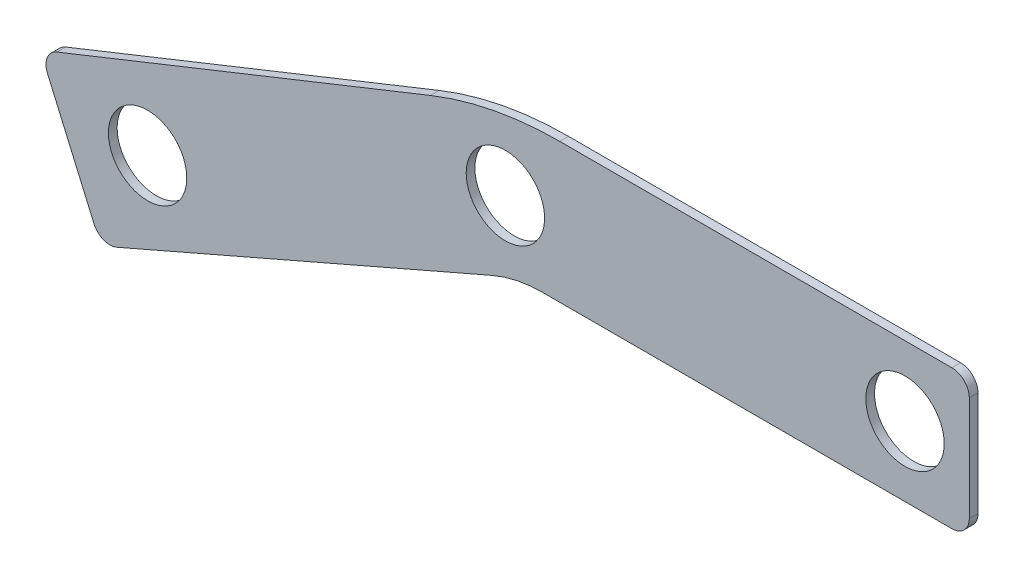
ISO-10303-21;
HEADER;
FILE_DESCRIPTION(('STEP AP214'),'2;1');
FILE_NAME('part.step','',(''),(''),'','','');
FILE_SCHEMA(('AUTOMOTIVE_DESIGN { 1 0 10303 214 1 1 1 1 }'));
ENDSEC;
DATA;
#1=APPLICATION_CONTEXT('core data for automotive mechanical design processes');
#2=APPLICATION_PROTOCOL_DEFINITION('international standard','automotive_design',2000,#1);
#3=PRODUCT_CONTEXT('',#1,'mechanical');
#4=PRODUCT('Part','Part','',(#3));
#5=PRODUCT_RELATED_PRODUCT_CATEGORY('part','',(#4));
#6=PRODUCT_DEFINITION_FORMATION('','',#4);
#7=PRODUCT_DEFINITION_CONTEXT('part definition',#1,'design');
#8=PRODUCT_DEFINITION('design','',#6,#7);
#9=PRODUCT_DEFINITION_SHAPE('','',#8);
#10=(LENGTH_UNIT() NAMED_UNIT(*) SI_UNIT(.MILLI.,.METRE.));
#11=(NAMED_UNIT(*) PLANE_ANGLE_UNIT() SI_UNIT($,.RADIAN.));
#12=(NAMED_UNIT(*) SI_UNIT($,.STERADIAN.) SOLID_ANGLE_UNIT());
#13=UNCERTAINTY_MEASURE_WITH_UNIT(LENGTH_MEASURE(1.E-05),#10,'distance_accuracy_value','');
#14=(GEOMETRIC_REPRESENTATION_CONTEXT(3) GLOBAL_UNCERTAINTY_ASSIGNED_CONTEXT((#13)) GLOBAL_UNIT_ASSIGNED_CONTEXT((#10,
#11,#12)) REPRESENTATION_CONTEXT('',''));
#15=CARTESIAN_POINT('',(0.,0.,0.));
#16=DIRECTION('',(0.,0.,1.));
#17=DIRECTION('',(1.,0.,0.));
#18=AXIS2_PLACEMENT_3D('',#15,#16,#17);
#19=CARTESIAN_POINT('',(0.,0.,3.175));
#20=DIRECTION('',(-0.398928701934795,0.916981946808452,0.));
#21=DIRECTION('',(-0.916981946808452,-0.398928701934795,0.));
#22=AXIS2_PLACEMENT_3D('',#19,#20,#21);
#23=PLANE('',#22);
#24=DIRECTION('',(0.916981946808452,0.398928701934795,0.));
#25=VECTOR('',#24,1.);
#26=CARTESIAN_POINT('',(0.,0.,3.175));
#27=LINE('',#26,#25);
#28=CARTESIAN_POINT('',(-145.570884055842,-63.3299314321487,3.175));
#29=VERTEX_POINT('',#28);
#30=CARTESIAN_POINT('',(-8.72457475503271,-3.79558539191755,3.175));
#31=VERTEX_POINT('',#30);
#32=EDGE_CURVE('E175',#29,#31,#27,.T.);
#33=ORIENTED_EDGE('',*,*,#32,.F.);
#34=DIRECTION('',(0.,0.,-1.));
#35=VECTOR('',#34,1.);
#36=CARTESIAN_POINT('',(-145.570884055842,-63.3299314321487,3.175));
#37=LINE('',#36,#35);
#38=CARTESIAN_POINT('',(-145.570884055842,-63.3299314321487,0.));
#39=VERTEX_POINT('',#38);
#40=EDGE_CURVE('E196',#29,#39,#37,.T.);
#41=ORIENTED_EDGE('',*,*,#40,.T.);
#42=DIRECTION('',(0.916981946808452,0.398928701934795,0.));
#43=VECTOR('',#42,1.);
#44=CARTESIAN_POINT('',(0.,0.,0.));
#45=LINE('',#44,#43);
#46=CARTESIAN_POINT('',(-8.72457475503271,-3.79558539191755,0.));
#47=VERTEX_POINT('',#46);
#48=EDGE_CURVE('E157',#39,#47,#45,.T.);
#49=ORIENTED_EDGE('',*,*,#48,.T.);
#50=DIRECTION('',(0.,0.,-1.));
#51=VECTOR('',#50,1.);
#52=CARTESIAN_POINT('',(-8.72457475503271,-3.79558539191755,3.175));
#53=LINE('',#52,#51);
#54=EDGE_CURVE('E136',#47,#31,#53,.F.);
#55=ORIENTED_EDGE('',*,*,#54,.T.);
#56=EDGE_LOOP('',(#33,#41,#49,#55));
#57=FACE_BOUND('',#56,.T.);
#58=ADVANCED_FACE('F39',(#57),#23,.F.);
#59=CARTESIAN_POINT('',(0.,0.,3.175));
#60=DIRECTION('',(0.,1.,0.));
#61=DIRECTION('',(0.,0.,1.));
#62=AXIS2_PLACEMENT_3D('',#59,#60,#61);
#63=PLANE('',#62);
#64=DIRECTION('',(1.,0.,0.));
#65=VECTOR('',#64,1.);
#66=CARTESIAN_POINT('',(0.,0.,0.));
#67=LINE('',#66,#65);
#68=CARTESIAN_POINT('',(9.51444549742612,0.,0.));
#69=VERTEX_POINT('',#68);
#70=CARTESIAN_POINT('',(158.75,0.,0.));
#71=VERTEX_POINT('',#70);
#72=EDGE_CURVE('E146',#69,#71,#67,.T.);
#73=ORIENTED_EDGE('',*,*,#72,.T.);
#74=DIRECTION('',(0.,0.,-1.));
#75=VECTOR('',#74,1.);
#76=CARTESIAN_POINT('',(158.75,0.,3.175));
#77=LINE('',#76,#75);
#78=CARTESIAN_POINT('',(158.75,0.,3.175));
#79=VERTEX_POINT('',#78);
#80=EDGE_CURVE('E230',#71,#79,#77,.F.);
#81=ORIENTED_EDGE('',*,*,#80,.T.);
#82=DIRECTION('',(1.,0.,0.));
#83=VECTOR('',#82,1.);
#84=CARTESIAN_POINT('',(0.,0.,3.175));
#85=LINE('',#84,#83);
#86=CARTESIAN_POINT('',(9.51444549742612,0.,3.175));
#87=VERTEX_POINT('',#86);
#88=EDGE_CURVE('E149',#87,#79,#85,.T.);
#89=ORIENTED_EDGE('',*,*,#88,.F.);
#90=DIRECTION('',(0.,0.,-1.));
#91=VECTOR('',#90,1.);
#92=CARTESIAN_POINT('',(9.51444549742612,0.,0.));
#93=LINE('',#92,#91);
#94=EDGE_CURVE('E134',#87,#69,#93,.T.);
#95=ORIENTED_EDGE('',*,*,#94,.T.);
#96=EDGE_LOOP('',(#73,#81,#89,#95));
#97=FACE_BOUND('',#96,.T.);
#98=ADVANCED_FACE('F145',(#97),#63,.F.);
#99=CARTESIAN_POINT('',(165.1,0.,3.175));
#100=DIRECTION('',(-1.,0.,0.));
#101=DIRECTION('',(0.,0.,1.));
#102=AXIS2_PLACEMENT_3D('',#99,#100,#101);
#103=PLANE('',#102);
#104=DIRECTION('',(0.,1.,0.));
#105=VECTOR('',#104,1.);
#106=CARTESIAN_POINT('',(165.1,0.,0.));
#107=LINE('',#106,#105);
#108=CARTESIAN_POINT('',(165.1,6.35,0.));
#109=VERTEX_POINT('',#108);
#110=CARTESIAN_POINT('',(165.1,44.45,0.));
#111=VERTEX_POINT('',#110);
#112=EDGE_CURVE('E156',#109,#111,#107,.T.);
#113=ORIENTED_EDGE('',*,*,#112,.T.);
#114=DIRECTION('',(0.,0.,-1.));
#115=VECTOR('',#114,1.);
#116=CARTESIAN_POINT('',(165.1,44.45,3.175));
#117=LINE('',#116,#115);
#118=CARTESIAN_POINT('',(165.1,44.45,3.175));
#119=VERTEX_POINT('',#118);
#120=EDGE_CURVE('E48',#111,#119,#117,.F.);
#121=ORIENTED_EDGE('',*,*,#120,.T.);
#122=DIRECTION('',(0.,1.,0.));
#123=VECTOR('',#122,1.);
#124=CARTESIAN_POINT('',(165.1,0.,3.175));
#125=LINE('',#124,#123);
#126=CARTESIAN_POINT('',(165.1,6.35,3.175));
#127=VERTEX_POINT('',#126);
#128=EDGE_CURVE('E250',#127,#119,#125,.T.);
#129=ORIENTED_EDGE('',*,*,#128,.F.);
#130=DIRECTION('',(0.,0.,-1.));
#131=VECTOR('',#130,1.);
#132=CARTESIAN_POINT('',(165.1,6.35,3.175));
#133=LINE('',#132,#131);
#134=EDGE_CURVE('E224',#127,#109,#133,.T.);
#135=ORIENTED_EDGE('',*,*,#134,.T.);
#136=EDGE_LOOP('',(#113,#121,#129,#135));
#137=FACE_BOUND('',#136,.T.);
#138=ADVANCED_FACE('F339',(#137),#103,.F.);
#139=CARTESIAN_POINT('',(165.1,50.8,3.175));
#140=DIRECTION('',(0.,-1.,0.));
#141=DIRECTION('',(1.,0.,0.));
#142=AXIS2_PLACEMENT_3D('',#139,#140,#141);
#143=PLANE('',#142);
#144=DIRECTION('',(-1.,0.,0.));
#145=VECTOR('',#144,1.);
#146=CARTESIAN_POINT('',(165.1,50.8,3.175));
#147=LINE('',#146,#145);
#148=CARTESIAN_POINT('',(158.75,50.8,3.175));
#149=VERTEX_POINT('',#148);
#150=CARTESIAN_POINT('',(15.8441401783756,50.8,3.175));
#151=VERTEX_POINT('',#150);
#152=EDGE_CURVE('E247',#149,#151,#147,.T.);
#153=ORIENTED_EDGE('',*,*,#152,.F.);
#154=DIRECTION('',(0.,0.,-1.));
#155=VECTOR('',#154,1.);
#156=CARTESIAN_POINT('',(158.75,50.8,3.175));
#157=LINE('',#156,#155);
#158=CARTESIAN_POINT('',(158.75,50.8,0.));
#159=VERTEX_POINT('',#158);
#160=EDGE_CURVE('E236',#149,#159,#157,.T.);
#161=ORIENTED_EDGE('',*,*,#160,.T.);
#162=DIRECTION('',(-1.,0.,0.));
#163=VECTOR('',#162,1.);
#164=CARTESIAN_POINT('',(165.1,50.8,0.));
#165=LINE('',#164,#163);
#166=CARTESIAN_POINT('',(15.8441401783756,50.8,0.));
#167=VERTEX_POINT('',#166);
#168=EDGE_CURVE('E161',#159,#167,#165,.T.);
#169=ORIENTED_EDGE('',*,*,#168,.T.);
#170=DIRECTION('',(0.,0.,-1.));
#171=VECTOR('',#170,1.);
#172=CARTESIAN_POINT('',(15.8441401783756,50.8,3.175));
#173=LINE('',#172,#171);
#174=EDGE_CURVE('E189',#167,#151,#173,.F.);
#175=ORIENTED_EDGE('',*,*,#174,.T.);
#176=EDGE_LOOP('',(#153,#161,#169,#175));
#177=FACE_BOUND('',#176,.T.);
#178=ADVANCED_FACE('F313',(#177),#143,.F.);
#179=CARTESIAN_POINT('',(-173.494021532879,-15.0631286894346,3.175));
#180=DIRECTION('',(0.370889847773687,-0.928676865663408,0.));
#181=DIRECTION('',(0.928676865663408,0.370889847773687,0.));
#182=AXIS2_PLACEMENT_3D('',#179,#180,#181);
#183=PLANE('',#182);
#184=DIRECTION('',(-0.928676865663408,-0.370889847773687,0.));
#185=VECTOR('',#184,1.);
#186=CARTESIAN_POINT('',(-173.494021532879,-15.0631286894346,0.));
#187=LINE('',#186,#185);
#188=CARTESIAN_POINT('',(-31.2588704888826,41.7419619392528,0.));
#189=VERTEX_POINT('',#188);
#190=CARTESIAN_POINT('',(-167.414984551764,-12.6353164073597,0.));
#191=VERTEX_POINT('',#190);
#192=EDGE_CURVE('E169',#189,#191,#187,.T.);
#193=ORIENTED_EDGE('',*,*,#192,.T.);
#194=DIRECTION('',(0.,0.,-1.));
#195=VECTOR('',#194,1.);
#196=CARTESIAN_POINT('',(-167.414984551764,-12.6353164073597,3.175));
#197=LINE('',#196,#195);
#198=CARTESIAN_POINT('',(-167.414984551764,-12.6353164073597,3.175));
#199=VERTEX_POINT('',#198);
#200=EDGE_CURVE('E218',#191,#199,#197,.F.);
#201=ORIENTED_EDGE('',*,*,#200,.T.);
#202=DIRECTION('',(-0.928676865663408,-0.370889847773687,0.));
#203=VECTOR('',#202,1.);
#204=CARTESIAN_POINT('',(-173.494021532879,-15.0631286894346,3.175));
#205=LINE('',#204,#203);
#206=CARTESIAN_POINT('',(-31.2588704888826,41.7419619392528,3.175));
#207=VERTEX_POINT('',#206);
#208=EDGE_CURVE('E244',#207,#199,#205,.T.);
#209=ORIENTED_EDGE('',*,*,#208,.F.);
#210=DIRECTION('',(0.,0.,-1.));
#211=VECTOR('',#210,1.);
#212=CARTESIAN_POINT('',(-31.2588704888826,41.7419619392528,3.175));
#213=LINE('',#212,#211);
#214=EDGE_CURVE('E181',#207,#189,#213,.T.);
#215=ORIENTED_EDGE('',*,*,#214,.T.);
#216=EDGE_LOOP('',(#193,#201,#209,#215));
#217=FACE_BOUND('',#216,.T.);
#218=ADVANCED_FACE('F323',(#217),#183,.F.);
#219=CARTESIAN_POINT('',(-151.393719418076,-65.8631286894346,3.175));
#220=DIRECTION('',(0.916981946808452,0.398928701934795,0.));
#221=DIRECTION('',(-0.398928701934795,0.916981946808453,0.));
#222=AXIS2_PLACEMENT_3D('',#219,#220,#221);
#223=PLANE('',#222);
#224=DIRECTION('',(0.398928701934795,-0.916981946808452,0.));
#225=VECTOR('',#224,1.);
#226=CARTESIAN_POINT('',(-151.393719418076,-65.8631286894346,3.175));
#227=LINE('',#226,#225);
#228=CARTESIAN_POINT('',(-170.882669380634,-21.0656117616082,3.175));
#229=VERTEX_POINT('',#228);
#230=CARTESIAN_POINT('',(-153.926916675361,-60.040293327201,3.175));
#231=VERTEX_POINT('',#230);
#232=EDGE_CURVE('E151',#229,#231,#227,.T.);
#233=ORIENTED_EDGE('',*,*,#232,.F.);
#234=DIRECTION('',(0.,0.,-1.));
#235=VECTOR('',#234,1.);
#236=CARTESIAN_POINT('',(-170.882669380634,-21.0656117616082,3.175));
#237=LINE('',#236,#235);
#238=CARTESIAN_POINT('',(-170.882669380634,-21.0656117616082,0.));
#239=VERTEX_POINT('',#238);
#240=EDGE_CURVE('E211',#229,#239,#237,.T.);
#241=ORIENTED_EDGE('',*,*,#240,.T.);
#242=DIRECTION('',(0.398928701934795,-0.916981946808452,0.));
#243=VECTOR('',#242,1.);
#244=CARTESIAN_POINT('',(-151.393719418076,-65.8631286894346,0.));
#245=LINE('',#244,#243);
#246=CARTESIAN_POINT('',(-153.926916675361,-60.040293327201,0.));
#247=VERTEX_POINT('',#246);
#248=EDGE_CURVE('E173',#239,#247,#245,.T.);
#249=ORIENTED_EDGE('',*,*,#248,.T.);
#250=DIRECTION('',(0.,0.,-1.));
#251=VECTOR('',#250,1.);
#252=CARTESIAN_POINT('',(-153.926916675361,-60.040293327201,3.175));
#253=LINE('',#252,#251);
#254=EDGE_CURVE('E204',#247,#231,#253,.F.);
#255=ORIENTED_EDGE('',*,*,#254,.T.);
#256=EDGE_LOOP('',(#233,#241,#249,#255));
#257=FACE_BOUND('',#256,.T.);
#258=ADVANCED_FACE('F303',(#257),#223,.F.);
#259=CARTESIAN_POINT('',(0.,0.,3.175));
#260=DIRECTION('',(0.,0.,-1.));
#261=DIRECTION('',(-1.,0.,0.));
#262=AXIS2_PLACEMENT_3D('',#259,#260,#261);
#263=PLANE('',#262);
#264=CARTESIAN_POINT('',(141.674387764191,25.4,3.175));
#265=DIRECTION('',(0.,0.,-1.));
#266=DIRECTION('',(-1.,0.,0.));
#267=AXIS2_PLACEMENT_3D('',#264,#265,#266);
#268=CIRCLE('',#267,14.2875);
#269=CARTESIAN_POINT('',(127.386887764191,25.4,3.175));
#270=VERTEX_POINT('',#269);
#271=EDGE_CURVE('E163',#270,#270,#268,.T.);
#272=ORIENTED_EDGE('',*,*,#271,.T.);
#273=EDGE_LOOP('',(#272));
#274=FACE_BOUND('',#273,.T.);
#275=CARTESIAN_POINT('',(-3.96966140540975,23.7779900810381,3.175));
#276=DIRECTION('',(0.,0.,-1.));
#277=DIRECTION('',(-1.,0.,0.));
#278=AXIS2_PLACEMENT_3D('',#275,#276,#277);
#279=CIRCLE('',#278,14.2875);
#280=CARTESIAN_POINT('',(-18.2571614054098,23.7779900810381,3.175));
#281=VERTEX_POINT('',#280);
#282=EDGE_CURVE('E263',#281,#281,#279,.T.);
#283=ORIENTED_EDGE('',*,*,#282,.T.);
#284=EDGE_LOOP('',(#283));
#285=FACE_BOUND('',#284,.T.);
#286=CARTESIAN_POINT('',(-134.369201796895,-28.767007742074,3.175));
#287=DIRECTION('',(0.,0.,-1.));
#288=DIRECTION('',(-1.,0.,0.));
#289=AXIS2_PLACEMENT_3D('',#286,#287,#288);
#290=CIRCLE('',#289,14.2875);
#291=CARTESIAN_POINT('',(-148.656701796895,-28.767007742074,3.175));
#292=VERTEX_POINT('',#291);
#293=EDGE_CURVE('E267',#292,#292,#290,.T.);
#294=ORIENTED_EDGE('',*,*,#293,.T.);
#295=EDGE_LOOP('',(#294));
#296=FACE_BOUND('',#295,.T.);
#297=ORIENTED_EDGE('',*,*,#128,.T.);
#298=CARTESIAN_POINT('',(158.75,44.45,3.175));
#299=DIRECTION('',(0.,0.,-1.));
#300=DIRECTION('',(-1.,0.,0.));
#301=AXIS2_PLACEMENT_3D('',#298,#299,#300);
#302=CIRCLE('',#301,6.35);
#303=EDGE_CURVE('E11',#119,#149,#302,.F.);
#304=ORIENTED_EDGE('',*,*,#303,.T.);
#305=ORIENTED_EDGE('',*,*,#152,.T.);
#306=CARTESIAN_POINT('',(15.8441401783756,-76.2,3.175));
#307=DIRECTION('',(0.,0.,-1.));
#308=DIRECTION('',(-1.,0.,0.));
#309=AXIS2_PLACEMENT_3D('',#306,#307,#308);
#310=CIRCLE('',#309,127.);
#311=EDGE_CURVE('E193',#151,#207,#310,.F.);
#312=ORIENTED_EDGE('',*,*,#311,.T.);
#313=ORIENTED_EDGE('',*,*,#208,.T.);
#314=CARTESIAN_POINT('',(-165.059834018401,-18.5324145043223,3.175));
#315=DIRECTION('',(0.,0.,-1.));
#316=DIRECTION('',(-1.,0.,0.));
#317=AXIS2_PLACEMENT_3D('',#314,#315,#316);
#318=CIRCLE('',#317,6.35);
#319=EDGE_CURVE('E221',#199,#229,#318,.F.);
#320=ORIENTED_EDGE('',*,*,#319,.T.);
#321=ORIENTED_EDGE('',*,*,#232,.T.);
#322=CARTESIAN_POINT('',(-148.104081313128,-57.507096069915,3.175));
#323=DIRECTION('',(0.,0.,-1.));
#324=DIRECTION('',(-1.,0.,0.));
#325=AXIS2_PLACEMENT_3D('',#322,#323,#324);
#326=CIRCLE('',#325,6.35);
#327=EDGE_CURVE('E208',#231,#29,#326,.F.);
#328=ORIENTED_EDGE('',*,*,#327,.T.);
#329=ORIENTED_EDGE('',*,*,#32,.T.);
#330=CARTESIAN_POINT('',(9.51444549742612,-45.72,3.175));
#331=DIRECTION('',(0.,0.,-1.));
#332=DIRECTION('',(-1.,0.,0.));
#333=AXIS2_PLACEMENT_3D('',#330,#331,#332);
#334=CIRCLE('',#333,45.72);
#335=EDGE_CURVE('E140',#31,#87,#334,.T.);
#336=ORIENTED_EDGE('',*,*,#335,.T.);
#337=ORIENTED_EDGE('',*,*,#88,.T.);
#338=CARTESIAN_POINT('',(158.75,6.35,3.175));
#339=DIRECTION('',(0.,0.,-1.));
#340=DIRECTION('',(-1.,0.,0.));
#341=AXIS2_PLACEMENT_3D('',#338,#339,#340);
#342=CIRCLE('',#341,6.35);
#343=EDGE_CURVE('E233',#79,#127,#342,.F.);
#344=ORIENTED_EDGE('',*,*,#343,.T.);
#345=EDGE_LOOP('',(#297,#304,#305,#312,#313,#320,#321,#328,#329,#336,#337,#344));
#346=FACE_BOUND('',#345,.T.);
#347=ADVANCED_FACE('F289',(#274,#285,#296,#346),#263,.F.);
#348=CARTESIAN_POINT('',(0.,0.,0.));
#349=DIRECTION('',(0.,0.,-1.));
#350=DIRECTION('',(-1.,0.,0.));
#351=AXIS2_PLACEMENT_3D('',#348,#349,#350);
#352=PLANE('',#351);
#353=CARTESIAN_POINT('',(141.674387764191,25.4,0.));
#354=DIRECTION('',(0.,0.,-1.));
#355=DIRECTION('',(-1.,0.,0.));
#356=AXIS2_PLACEMENT_3D('',#353,#354,#355);
#357=CIRCLE('',#356,14.2875);
#358=CARTESIAN_POINT('',(127.386887764191,25.4,0.));
#359=VERTEX_POINT('',#358);
#360=EDGE_CURVE('E271',#359,#359,#357,.T.);
#361=ORIENTED_EDGE('',*,*,#360,.F.);
#362=EDGE_LOOP('',(#361));
#363=FACE_BOUND('',#362,.T.);
#364=CARTESIAN_POINT('',(-3.96966140540975,23.7779900810381,0.));
#365=DIRECTION('',(0.,0.,-1.));
#366=DIRECTION('',(-1.,0.,0.));
#367=AXIS2_PLACEMENT_3D('',#364,#365,#366);
#368=CIRCLE('',#367,14.2875);
#369=CARTESIAN_POINT('',(-18.2571614054098,23.7779900810381,0.));
#370=VERTEX_POINT('',#369);
#371=EDGE_CURVE('E276',#370,#370,#368,.T.);
#372=ORIENTED_EDGE('',*,*,#371,.F.);
#373=EDGE_LOOP('',(#372));
#374=FACE_BOUND('',#373,.T.);
#375=CARTESIAN_POINT('',(-134.369201796895,-28.767007742074,0.));
#376=DIRECTION('',(0.,0.,-1.));
#377=DIRECTION('',(-1.,0.,0.));
#378=AXIS2_PLACEMENT_3D('',#375,#376,#377);
#379=CIRCLE('',#378,14.2875);
#380=CARTESIAN_POINT('',(-148.656701796895,-28.767007742074,0.));
#381=VERTEX_POINT('',#380);
#382=EDGE_CURVE('E272',#381,#381,#379,.T.);
#383=ORIENTED_EDGE('',*,*,#382,.F.);
#384=EDGE_LOOP('',(#383));
#385=FACE_BOUND('',#384,.T.);
#386=ORIENTED_EDGE('',*,*,#168,.F.);
#387=CARTESIAN_POINT('',(158.75,44.45,0.));
#388=DIRECTION('',(0.,0.,-1.));
#389=DIRECTION('',(-1.,0.,0.));
#390=AXIS2_PLACEMENT_3D('',#387,#388,#389);
#391=CIRCLE('',#390,6.35);
#392=EDGE_CURVE('E62',#159,#111,#391,.T.);
#393=ORIENTED_EDGE('',*,*,#392,.T.);
#394=ORIENTED_EDGE('',*,*,#112,.F.);
#395=CARTESIAN_POINT('',(158.75,6.35,0.));
#396=DIRECTION('',(0.,0.,-1.));
#397=DIRECTION('',(-1.,0.,0.));
#398=AXIS2_PLACEMENT_3D('',#395,#396,#397);
#399=CIRCLE('',#398,6.35);
#400=EDGE_CURVE('E154',#109,#71,#399,.T.);
#401=ORIENTED_EDGE('',*,*,#400,.T.);
#402=ORIENTED_EDGE('',*,*,#72,.F.);
#403=CARTESIAN_POINT('',(9.51444549742612,-45.72,0.));
#404=DIRECTION('',(0.,0.,-1.));
#405=DIRECTION('',(-1.,0.,0.));
#406=AXIS2_PLACEMENT_3D('',#403,#404,#405);
#407=CIRCLE('',#406,45.72);
#408=EDGE_CURVE('E130',#69,#47,#407,.F.);
#409=ORIENTED_EDGE('',*,*,#408,.T.);
#410=ORIENTED_EDGE('',*,*,#48,.F.);
#411=CARTESIAN_POINT('',(-148.104081313128,-57.507096069915,0.));
#412=DIRECTION('',(0.,0.,-1.));
#413=DIRECTION('',(-1.,0.,0.));
#414=AXIS2_PLACEMENT_3D('',#411,#412,#413);
#415=CIRCLE('',#414,6.35);
#416=EDGE_CURVE('E200',#39,#247,#415,.T.);
#417=ORIENTED_EDGE('',*,*,#416,.T.);
#418=ORIENTED_EDGE('',*,*,#248,.F.);
#419=CARTESIAN_POINT('',(-165.059834018401,-18.5324145043223,0.));
#420=DIRECTION('',(0.,0.,-1.));
#421=DIRECTION('',(-1.,0.,0.));
#422=AXIS2_PLACEMENT_3D('',#419,#420,#421);
#423=CIRCLE('',#422,6.35);
#424=EDGE_CURVE('E215',#239,#191,#423,.T.);
#425=ORIENTED_EDGE('',*,*,#424,.T.);
#426=ORIENTED_EDGE('',*,*,#192,.F.);
#427=CARTESIAN_POINT('',(15.8441401783756,-76.2,0.));
#428=DIRECTION('',(0.,0.,-1.));
#429=DIRECTION('',(-1.,0.,0.));
#430=AXIS2_PLACEMENT_3D('',#427,#428,#429);
#431=CIRCLE('',#430,127.);
#432=EDGE_CURVE('E185',#189,#167,#431,.T.);
#433=ORIENTED_EDGE('',*,*,#432,.T.);
#434=EDGE_LOOP('',(#386,#393,#394,#401,#402,#409,#410,#417,#418,#425,#426,#433));
#435=FACE_BOUND('',#434,.T.);
#436=ADVANCED_FACE('F153',(#363,#374,#385,#435),#352,.T.);
#437=CARTESIAN_POINT('',(9.51444549742612,-45.72,3.175));
#438=DIRECTION('',(0.,0.,1.));
#439=DIRECTION('',(1.,0.,0.));
#440=AXIS2_PLACEMENT_3D('',#437,#438,#439);
#441=CYLINDRICAL_SURFACE('',#440,45.72);
#442=ORIENTED_EDGE('',*,*,#335,.F.);
#443=ORIENTED_EDGE('',*,*,#54,.F.);
#444=ORIENTED_EDGE('',*,*,#408,.F.);
#445=ORIENTED_EDGE('',*,*,#94,.F.);
#446=EDGE_LOOP('',(#442,#443,#444,#445));
#447=FACE_BOUND('',#446,.T.);
#448=ADVANCED_FACE('F133',(#447),#441,.F.);
#449=CARTESIAN_POINT('',(15.8441401783756,-76.2,3.175));
#450=DIRECTION('',(0.,0.,-1.));
#451=DIRECTION('',(-1.,0.,0.));
#452=AXIS2_PLACEMENT_3D('',#449,#450,#451);
#453=CYLINDRICAL_SURFACE('',#452,127.);
#454=ORIENTED_EDGE('',*,*,#311,.F.);
#455=ORIENTED_EDGE('',*,*,#174,.F.);
#456=ORIENTED_EDGE('',*,*,#432,.F.);
#457=ORIENTED_EDGE('',*,*,#214,.F.);
#458=EDGE_LOOP('',(#454,#455,#456,#457));
#459=FACE_BOUND('',#458,.T.);
#460=ADVANCED_FACE('F319',(#459),#453,.T.);
#461=CARTESIAN_POINT('',(-148.104081313128,-57.507096069915,3.175));
#462=DIRECTION('',(0.,0.,-1.));
#463=DIRECTION('',(-1.,0.,0.));
#464=AXIS2_PLACEMENT_3D('',#461,#462,#463);
#465=CYLINDRICAL_SURFACE('',#464,6.35);
#466=ORIENTED_EDGE('',*,*,#327,.F.);
#467=ORIENTED_EDGE('',*,*,#254,.F.);
#468=ORIENTED_EDGE('',*,*,#416,.F.);
#469=ORIENTED_EDGE('',*,*,#40,.F.);
#470=EDGE_LOOP('',(#466,#467,#468,#469));
#471=FACE_BOUND('',#470,.T.);
#472=ADVANCED_FACE('F335',(#471),#465,.T.);
#473=CARTESIAN_POINT('',(-165.059834018401,-18.5324145043223,3.175));
#474=DIRECTION('',(0.,0.,-1.));
#475=DIRECTION('',(-1.,0.,0.));
#476=AXIS2_PLACEMENT_3D('',#473,#474,#475);
#477=CYLINDRICAL_SURFACE('',#476,6.35);
#478=ORIENTED_EDGE('',*,*,#319,.F.);
#479=ORIENTED_EDGE('',*,*,#200,.F.);
#480=ORIENTED_EDGE('',*,*,#424,.F.);
#481=ORIENTED_EDGE('',*,*,#240,.F.);
#482=EDGE_LOOP('',(#478,#479,#480,#481));
#483=FACE_BOUND('',#482,.T.);
#484=ADVANCED_FACE('F326',(#483),#477,.T.);
#485=CARTESIAN_POINT('',(158.75,6.35,3.175));
#486=DIRECTION('',(0.,0.,-1.));
#487=DIRECTION('',(-1.,0.,0.));
#488=AXIS2_PLACEMENT_3D('',#485,#486,#487);
#489=CYLINDRICAL_SURFACE('',#488,6.35);
#490=ORIENTED_EDGE('',*,*,#343,.F.);
#491=ORIENTED_EDGE('',*,*,#80,.F.);
#492=ORIENTED_EDGE('',*,*,#400,.F.);
#493=ORIENTED_EDGE('',*,*,#134,.F.);
#494=EDGE_LOOP('',(#490,#491,#492,#493));
#495=FACE_BOUND('',#494,.T.);
#496=ADVANCED_FACE('F338',(#495),#489,.T.);
#497=CARTESIAN_POINT('',(158.75,44.45,3.175));
#498=DIRECTION('',(0.,0.,-1.));
#499=DIRECTION('',(-1.,0.,0.));
#500=AXIS2_PLACEMENT_3D('',#497,#498,#499);
#501=CYLINDRICAL_SURFACE('',#500,6.35);
#502=ORIENTED_EDGE('',*,*,#303,.F.);
#503=ORIENTED_EDGE('',*,*,#120,.F.);
#504=ORIENTED_EDGE('',*,*,#392,.F.);
#505=ORIENTED_EDGE('',*,*,#160,.F.);
#506=EDGE_LOOP('',(#502,#503,#504,#505));
#507=FACE_BOUND('',#506,.T.);
#508=ADVANCED_FACE('F41',(#507),#501,.T.);
#509=CARTESIAN_POINT('',(-134.369201796895,-28.767007742074,18.415));
#510=DIRECTION('',(0.,0.,-1.));
#511=DIRECTION('',(-1.,0.,0.));
#512=AXIS2_PLACEMENT_3D('',#509,#510,#511);
#513=CYLINDRICAL_SURFACE('',#512,14.2875);
#514=ORIENTED_EDGE('',*,*,#382,.T.);
#515=EDGE_LOOP('',(#514));
#516=FACE_BOUND('',#515,.T.);
#517=ORIENTED_EDGE('',*,*,#293,.F.);
#518=EDGE_LOOP('',(#517));
#519=FACE_BOUND('',#518,.T.);
#520=ADVANCED_FACE('F295',(#516,#519),#513,.F.);
#521=CARTESIAN_POINT('',(-3.96966140540975,23.7779900810381,18.415));
#522=DIRECTION('',(0.,0.,-1.));
#523=DIRECTION('',(-1.,0.,0.));
#524=AXIS2_PLACEMENT_3D('',#521,#522,#523);
#525=CYLINDRICAL_SURFACE('',#524,14.2875);
#526=ORIENTED_EDGE('',*,*,#371,.T.);
#527=EDGE_LOOP('',(#526));
#528=FACE_BOUND('',#527,.T.);
#529=ORIENTED_EDGE('',*,*,#282,.F.);
#530=EDGE_LOOP('',(#529));
#531=FACE_BOUND('',#530,.T.);
#532=ADVANCED_FACE('F298',(#528,#531),#525,.F.);
#533=CARTESIAN_POINT('',(141.674387764191,25.4,18.415));
#534=DIRECTION('',(0.,0.,-1.));
#535=DIRECTION('',(-1.,0.,0.));
#536=AXIS2_PLACEMENT_3D('',#533,#534,#535);
#537=CYLINDRICAL_SURFACE('',#536,14.2875);
#538=ORIENTED_EDGE('',*,*,#360,.T.);
#539=EDGE_LOOP('',(#538));
#540=FACE_BOUND('',#539,.T.);
#541=ORIENTED_EDGE('',*,*,#271,.F.);
#542=EDGE_LOOP('',(#541));
#543=FACE_BOUND('',#542,.T.);
#544=ADVANCED_FACE('F284',(#540,#543),#537,.F.);
#545=CLOSED_SHELL('',(#58,#98,#138,#178,#218,#258,#347,#436,#448,#460,#472,#484,#496,#508,#520,
#532,#544));
#546=MANIFOLD_SOLID_BREP('B2',#545);
#547=ADVANCED_BREP_SHAPE_REPRESENTATION('',(#18,#546),#14);
#548=SHAPE_DEFINITION_REPRESENTATION(#9,#547);
ENDSEC;
END-ISO-10303-21;
